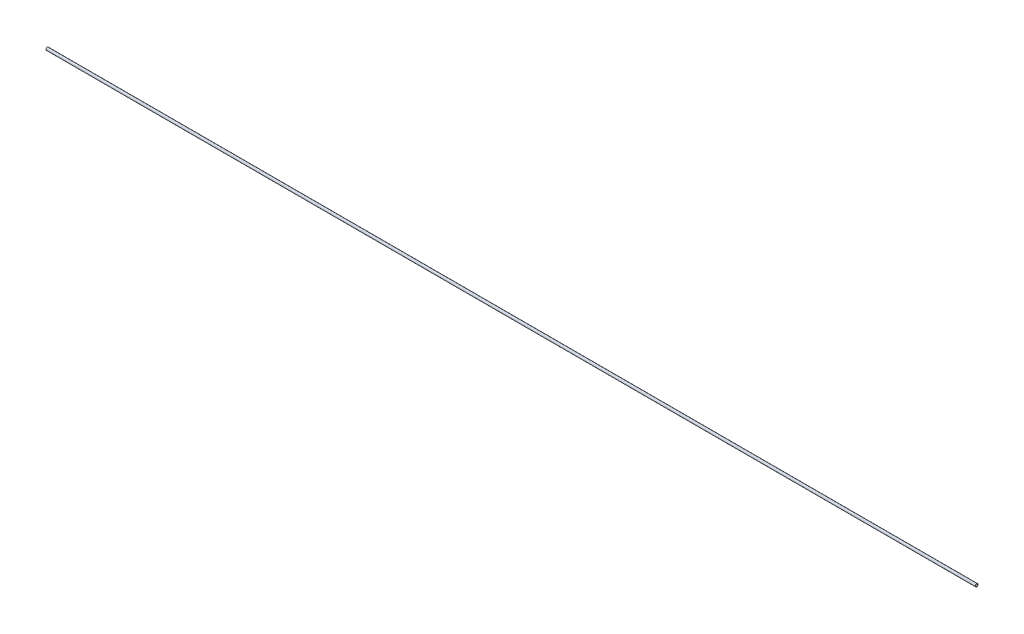
ISO-10303-21;
HEADER;
FILE_DESCRIPTION(('STEP AP214'),'2;1');
FILE_NAME('part.step','',(''),(''),'','','');
FILE_SCHEMA(('AUTOMOTIVE_DESIGN { 1 0 10303 214 1 1 1 1 }'));
ENDSEC;
DATA;
#1=APPLICATION_CONTEXT('core data for automotive mechanical design processes');
#2=APPLICATION_PROTOCOL_DEFINITION('international standard','automotive_design',2000,#1);
#3=PRODUCT_CONTEXT('',#1,'mechanical');
#4=PRODUCT('Part','Part','',(#3));
#5=PRODUCT_RELATED_PRODUCT_CATEGORY('part','',(#4));
#6=PRODUCT_DEFINITION_FORMATION('','',#4);
#7=PRODUCT_DEFINITION_CONTEXT('part definition',#1,'design');
#8=PRODUCT_DEFINITION('design','',#6,#7);
#9=PRODUCT_DEFINITION_SHAPE('','',#8);
#10=(LENGTH_UNIT() NAMED_UNIT(*) SI_UNIT(.MILLI.,.METRE.));
#11=(NAMED_UNIT(*) PLANE_ANGLE_UNIT() SI_UNIT($,.RADIAN.));
#12=(NAMED_UNIT(*) SI_UNIT($,.STERADIAN.) SOLID_ANGLE_UNIT());
#13=UNCERTAINTY_MEASURE_WITH_UNIT(LENGTH_MEASURE(1.E-05),#10,'distance_accuracy_value','');
#14=(GEOMETRIC_REPRESENTATION_CONTEXT(3) GLOBAL_UNCERTAINTY_ASSIGNED_CONTEXT((#13)) GLOBAL_UNIT_ASSIGNED_CONTEXT((#10,
#11,#12)) REPRESENTATION_CONTEXT('',''));
#15=CARTESIAN_POINT('',(0.,0.,0.));
#16=DIRECTION('',(0.,0.,1.));
#17=DIRECTION('',(1.,0.,0.));
#18=AXIS2_PLACEMENT_3D('',#15,#16,#17);
#19=CARTESIAN_POINT('',(1651.,0.,0.));
#20=DIRECTION('',(1.,0.,0.));
#21=DIRECTION('',(0.,0.,-1.));
#22=AXIS2_PLACEMENT_3D('',#19,#20,#21);
#23=PLANE('',#22);
#24=CARTESIAN_POINT('',(1651.,0.,0.));
#25=DIRECTION('',(1.,0.,0.));
#26=DIRECTION('',(0.,0.,-1.));
#27=AXIS2_PLACEMENT_3D('',#24,#25,#26);
#28=CIRCLE('',#27,2.38125);
#29=CARTESIAN_POINT('',(1651.,0.,-2.38125));
#30=VERTEX_POINT('',#29);
#31=EDGE_CURVE('E10',#30,#30,#28,.T.);
#32=ORIENTED_EDGE('',*,*,#31,.T.);
#33=EDGE_LOOP('',(#32));
#34=FACE_BOUND('',#33,.T.);
#35=CARTESIAN_POINT('',(1651.,0.,0.));
#36=DIRECTION('',(1.,0.,0.));
#37=DIRECTION('',(0.,0.,-1.));
#38=AXIS2_PLACEMENT_3D('',#35,#36,#37);
#39=CIRCLE('',#38,1.82245);
#40=CARTESIAN_POINT('',(1651.,0.,-1.82245));
#41=VERTEX_POINT('',#40);
#42=EDGE_CURVE('E47',#41,#41,#39,.T.);
#43=ORIENTED_EDGE('',*,*,#42,.F.);
#44=EDGE_LOOP('',(#43));
#45=FACE_BOUND('',#44,.T.);
#46=ADVANCED_FACE('F34',(#34,#45),#23,.T.);
#47=CARTESIAN_POINT('',(0.,0.,0.));
#48=DIRECTION('',(1.,0.,0.));
#49=DIRECTION('',(0.,0.,-1.));
#50=AXIS2_PLACEMENT_3D('',#47,#48,#49);
#51=PLANE('',#50);
#52=CARTESIAN_POINT('',(0.,0.,0.));
#53=DIRECTION('',(1.,0.,0.));
#54=DIRECTION('',(0.,0.,-1.));
#55=AXIS2_PLACEMENT_3D('',#52,#53,#54);
#56=CIRCLE('',#55,2.38125);
#57=CARTESIAN_POINT('',(0.,0.,-2.38125));
#58=VERTEX_POINT('',#57);
#59=EDGE_CURVE('E38',#58,#58,#56,.T.);
#60=ORIENTED_EDGE('',*,*,#59,.F.);
#61=EDGE_LOOP('',(#60));
#62=FACE_BOUND('',#61,.T.);
#63=CARTESIAN_POINT('',(0.,0.,0.));
#64=DIRECTION('',(1.,0.,0.));
#65=DIRECTION('',(0.,0.,-1.));
#66=AXIS2_PLACEMENT_3D('',#63,#64,#65);
#67=CIRCLE('',#66,1.82245);
#68=CARTESIAN_POINT('',(0.,0.,-1.82245));
#69=VERTEX_POINT('',#68);
#70=EDGE_CURVE('E49',#69,#69,#67,.T.);
#71=ORIENTED_EDGE('',*,*,#70,.T.);
#72=EDGE_LOOP('',(#71));
#73=FACE_BOUND('',#72,.T.);
#74=ADVANCED_FACE('F59',(#62,#73),#51,.F.);
#75=CARTESIAN_POINT('',(1651.,0.,0.));
#76=DIRECTION('',(-1.,0.,0.));
#77=DIRECTION('',(0.,0.,1.));
#78=AXIS2_PLACEMENT_3D('',#75,#76,#77);
#79=CYLINDRICAL_SURFACE('',#78,2.38125);
#80=ORIENTED_EDGE('',*,*,#31,.F.);
#81=EDGE_LOOP('',(#80));
#82=FACE_BOUND('',#81,.T.);
#83=ORIENTED_EDGE('',*,*,#59,.T.);
#84=EDGE_LOOP('',(#83));
#85=FACE_BOUND('',#84,.T.);
#86=ADVANCED_FACE('F36',(#82,#85),#79,.T.);
#87=CARTESIAN_POINT('',(1651.,0.,0.));
#88=DIRECTION('',(-1.,0.,0.));
#89=DIRECTION('',(0.,0.,1.));
#90=AXIS2_PLACEMENT_3D('',#87,#88,#89);
#91=CYLINDRICAL_SURFACE('',#90,1.82245);
#92=ORIENTED_EDGE('',*,*,#42,.T.);
#93=EDGE_LOOP('',(#92));
#94=FACE_BOUND('',#93,.T.);
#95=ORIENTED_EDGE('',*,*,#70,.F.);
#96=EDGE_LOOP('',(#95));
#97=FACE_BOUND('',#96,.T.);
#98=ADVANCED_FACE('F55',(#94,#97),#91,.F.);
#99=CLOSED_SHELL('',(#46,#74,#86,#98));
#100=MANIFOLD_SOLID_BREP('B2',#99);
#101=ADVANCED_BREP_SHAPE_REPRESENTATION('',(#18,#100),#14);
#102=SHAPE_DEFINITION_REPRESENTATION(#9,#101);
ENDSEC;
END-ISO-10303-21;
